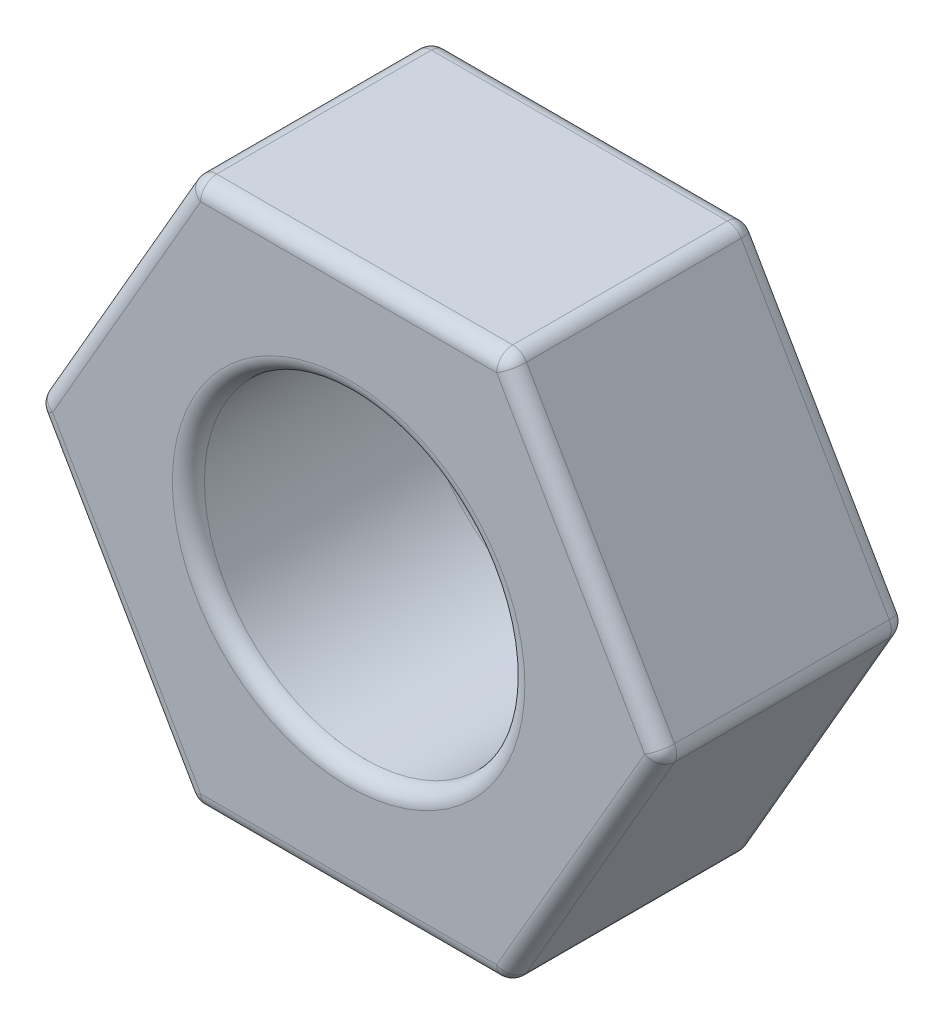
ISO-10303-21;
HEADER;
FILE_DESCRIPTION(('STEP AP214'),'2;1');
FILE_NAME('part.step','',(''),(''),'','','');
FILE_SCHEMA(('AUTOMOTIVE_DESIGN { 1 0 10303 214 1 1 1 1 }'));
ENDSEC;
DATA;
#1=APPLICATION_CONTEXT('core data for automotive mechanical design processes');
#2=APPLICATION_PROTOCOL_DEFINITION('international standard','automotive_design',2000,#1);
#3=PRODUCT_CONTEXT('',#1,'mechanical');
#4=PRODUCT('Part','Part','',(#3));
#5=PRODUCT_RELATED_PRODUCT_CATEGORY('part','',(#4));
#6=PRODUCT_DEFINITION_FORMATION('','',#4);
#7=PRODUCT_DEFINITION_CONTEXT('part definition',#1,'design');
#8=PRODUCT_DEFINITION('design','',#6,#7);
#9=PRODUCT_DEFINITION_SHAPE('','',#8);
#10=(LENGTH_UNIT() NAMED_UNIT(*) SI_UNIT(.MILLI.,.METRE.));
#11=(NAMED_UNIT(*) PLANE_ANGLE_UNIT() SI_UNIT($,.RADIAN.));
#12=(NAMED_UNIT(*) SI_UNIT($,.STERADIAN.) SOLID_ANGLE_UNIT());
#13=UNCERTAINTY_MEASURE_WITH_UNIT(LENGTH_MEASURE(1.E-05),#10,'distance_accuracy_value','');
#14=(GEOMETRIC_REPRESENTATION_CONTEXT(3) GLOBAL_UNCERTAINTY_ASSIGNED_CONTEXT((#13)) GLOBAL_UNIT_ASSIGNED_CONTEXT((#10,
#11,#12)) REPRESENTATION_CONTEXT('',''));
#15=CARTESIAN_POINT('',(0.,0.,0.));
#16=DIRECTION('',(0.,0.,1.));
#17=DIRECTION('',(1.,0.,0.));
#18=AXIS2_PLACEMENT_3D('',#15,#16,#17);
#19=CARTESIAN_POINT('',(0.,0.,3.85));
#20=DIRECTION('',(0.,0.,1.));
#21=DIRECTION('',(1.,0.,0.));
#22=AXIS2_PLACEMENT_3D('',#19,#20,#21);
#23=PLANE('',#22);
#24=DIRECTION('',(-0.500000000000007,0.866025403784435,0.));
#25=VECTOR('',#24,1.);
#26=CARTESIAN_POINT('',(4.47446458621952,8.25000000000004,3.85));
#27=LINE('',#26,#25);
#28=CARTESIAN_POINT('',(9.23760430703401,0.,3.85));
#29=VERTEX_POINT('',#28);
#30=CARTESIAN_POINT('',(4.61880215351693,8.00000000000004,3.85));
#31=VERTEX_POINT('',#30);
#32=EDGE_CURVE('E256',#29,#31,#27,.T.);
#33=ORIENTED_EDGE('',*,*,#32,.T.);
#34=DIRECTION('',(-1.,0.,0.));
#35=VECTOR('',#34,1.);
#36=CARTESIAN_POINT('',(-4.90747728811191,7.99999999999994,3.85));
#37=LINE('',#36,#35);
#38=CARTESIAN_POINT('',(-4.6188021535171,7.99999999999995,3.85));
#39=VERTEX_POINT('',#38);
#40=EDGE_CURVE('E258',#31,#39,#37,.T.);
#41=ORIENTED_EDGE('',*,*,#40,.T.);
#42=DIRECTION('',(-0.499999999999995,-0.866025403784442,0.));
#43=VECTOR('',#42,1.);
#44=CARTESIAN_POINT('',(-9.38194187433142,-0.249999999999998,3.85));
#45=LINE('',#44,#43);
#46=CARTESIAN_POINT('',(-9.23760430703402,0.,3.85));
#47=VERTEX_POINT('',#46);
#48=EDGE_CURVE('E248',#39,#47,#45,.T.);
#49=ORIENTED_EDGE('',*,*,#48,.T.);
#50=DIRECTION('',(0.500000000000001,-0.866025403784438,0.));
#51=VECTOR('',#50,1.);
#52=CARTESIAN_POINT('',(-4.47446458621958,-8.25000000000001,3.85));
#53=LINE('',#52,#51);
#54=CARTESIAN_POINT('',(-4.61880215351699,-8.00000000000001,3.85));
#55=VERTEX_POINT('',#54);
#56=EDGE_CURVE('E250',#47,#55,#53,.T.);
#57=ORIENTED_EDGE('',*,*,#56,.T.);
#58=DIRECTION('',(1.,0.,0.));
#59=VECTOR('',#58,1.);
#60=CARTESIAN_POINT('',(4.90747728811186,-7.99999999999998,3.85));
#61=LINE('',#60,#59);
#62=CARTESIAN_POINT('',(4.61880215351704,-7.99999999999998,3.85));
#63=VERTEX_POINT('',#62);
#64=EDGE_CURVE('E252',#55,#63,#61,.T.);
#65=ORIENTED_EDGE('',*,*,#64,.T.);
#66=DIRECTION('',(0.499999999999995,0.866025403784442,0.));
#67=VECTOR('',#66,1.);
#68=CARTESIAN_POINT('',(9.38194187433142,0.250000000000067,3.85));
#69=LINE('',#68,#67);
#70=EDGE_CURVE('E254',#63,#29,#69,.T.);
#71=ORIENTED_EDGE('',*,*,#70,.T.);
#72=EDGE_LOOP('',(#33,#41,#49,#57,#65,#71));
#73=FACE_BOUND('',#72,.T.);
#74=CARTESIAN_POINT('',(0.,0.,3.85));
#75=DIRECTION('',(0.,0.,1.));
#76=DIRECTION('',(1.,0.,0.));
#77=AXIS2_PLACEMENT_3D('',#74,#75,#76);
#78=CIRCLE('',#77,5.5);
#79=CARTESIAN_POINT('',(5.5,0.,3.85));
#80=VERTEX_POINT('',#79);
#81=EDGE_CURVE('E245',#80,#80,#78,.F.);
#82=ORIENTED_EDGE('',*,*,#81,.T.);
#83=EDGE_LOOP('',(#82));
#84=FACE_BOUND('',#83,.T.);
#85=ADVANCED_FACE('F34',(#73,#84),#23,.T.);
#86=CARTESIAN_POINT('',(0.,0.,-3.85));
#87=DIRECTION('',(0.,0.,1.));
#88=DIRECTION('',(1.,0.,0.));
#89=AXIS2_PLACEMENT_3D('',#86,#87,#88);
#90=PLANE('',#89);
#91=DIRECTION('',(-0.499999999999995,-0.866025403784442,0.));
#92=VECTOR('',#91,1.);
#93=CARTESIAN_POINT('',(-6.92820323027556,3.99999999999998,-3.85));
#94=LINE('',#93,#92);
#95=CARTESIAN_POINT('',(-9.23760430703402,0.,-3.85));
#96=VERTEX_POINT('',#95);
#97=CARTESIAN_POINT('',(-4.6188021535171,7.99999999999995,-3.85));
#98=VERTEX_POINT('',#97);
#99=EDGE_CURVE('E264',#96,#98,#94,.F.);
#100=ORIENTED_EDGE('',*,*,#99,.T.);
#101=DIRECTION('',(-1.,0.,0.));
#102=VECTOR('',#101,1.);
#103=CARTESIAN_POINT('',(0.,7.99999999999999,-3.85));
#104=LINE('',#103,#102);
#105=CARTESIAN_POINT('',(4.61880215351693,8.00000000000004,-3.85));
#106=VERTEX_POINT('',#105);
#107=EDGE_CURVE('E273',#98,#106,#104,.F.);
#108=ORIENTED_EDGE('',*,*,#107,.T.);
#109=DIRECTION('',(-0.500000000000007,0.866025403784435,0.));
#110=VECTOR('',#109,1.);
#111=CARTESIAN_POINT('',(6.92820323027547,4.00000000000005,-3.85));
#112=LINE('',#111,#110);
#113=CARTESIAN_POINT('',(9.23760430703401,0.,-3.85));
#114=VERTEX_POINT('',#113);
#115=EDGE_CURVE('E59',#106,#114,#112,.F.);
#116=ORIENTED_EDGE('',*,*,#115,.T.);
#117=DIRECTION('',(0.499999999999995,0.866025403784442,0.));
#118=VECTOR('',#117,1.);
#119=CARTESIAN_POINT('',(6.92820323027553,-3.99999999999996,-3.85));
#120=LINE('',#119,#118);
#121=CARTESIAN_POINT('',(4.61880215351704,-7.99999999999998,-3.85));
#122=VERTEX_POINT('',#121);
#123=EDGE_CURVE('E270',#114,#122,#120,.F.);
#124=ORIENTED_EDGE('',*,*,#123,.T.);
#125=DIRECTION('',(1.,0.,0.));
#126=VECTOR('',#125,1.);
#127=CARTESIAN_POINT('',(0.,-7.99999999999999,-3.85));
#128=LINE('',#127,#126);
#129=CARTESIAN_POINT('',(-4.61880215351699,-8.00000000000001,-3.85));
#130=VERTEX_POINT('',#129);
#131=EDGE_CURVE('E268',#122,#130,#128,.F.);
#132=ORIENTED_EDGE('',*,*,#131,.T.);
#133=DIRECTION('',(0.500000000000001,-0.866025403784438,0.));
#134=VECTOR('',#133,1.);
#135=CARTESIAN_POINT('',(-6.9282032302755,-4.00000000000001,-3.85));
#136=LINE('',#135,#134);
#137=EDGE_CURVE('E266',#130,#96,#136,.F.);
#138=ORIENTED_EDGE('',*,*,#137,.T.);
#139=EDGE_LOOP('',(#100,#108,#116,#124,#132,#138));
#140=FACE_BOUND('',#139,.T.);
#141=CARTESIAN_POINT('',(0.,0.,-3.85));
#142=DIRECTION('',(0.,0.,1.));
#143=DIRECTION('',(1.,0.,0.));
#144=AXIS2_PLACEMENT_3D('',#141,#142,#143);
#145=CIRCLE('',#144,5.5);
#146=CARTESIAN_POINT('',(5.5,0.,-3.85));
#147=VERTEX_POINT('',#146);
#148=EDGE_CURVE('E261',#147,#147,#145,.T.);
#149=ORIENTED_EDGE('',*,*,#148,.T.);
#150=EDGE_LOOP('',(#149));
#151=FACE_BOUND('',#150,.T.);
#152=ADVANCED_FACE('F433',(#140,#151),#90,.F.);
#153=CARTESIAN_POINT('',(-4.90747728811192,8.49999999999994,3.85));
#154=DIRECTION('',(0.866025403784442,-0.499999999999995,0.));
#155=DIRECTION('',(0.499999999999995,0.866025403784442,0.));
#156=AXIS2_PLACEMENT_3D('',#153,#154,#155);
#157=PLANE('',#156);
#158=DIRECTION('',(0.,0.,-1.));
#159=VECTOR('',#158,1.);
#160=CARTESIAN_POINT('',(-9.67061700892623,0.249999999999999,3.85));
#161=LINE('',#160,#159);
#162=CARTESIAN_POINT('',(-9.67061700892623,0.25,-3.35));
#163=VERTEX_POINT('',#162);
#164=CARTESIAN_POINT('',(-9.67061700892623,0.25,3.35));
#165=VERTEX_POINT('',#164);
#166=EDGE_CURVE('E170',#163,#165,#161,.F.);
#167=ORIENTED_EDGE('',*,*,#166,.T.);
#168=DIRECTION('',(-0.499999999999995,-0.866025403784442,0.));
#169=VECTOR('',#168,1.);
#170=CARTESIAN_POINT('',(-4.90747728811192,8.49999999999994,3.35));
#171=LINE('',#170,#169);
#172=CARTESIAN_POINT('',(-5.05181485540932,8.24999999999994,3.35));
#173=VERTEX_POINT('',#172);
#174=EDGE_CURVE('E207',#165,#173,#171,.F.);
#175=ORIENTED_EDGE('',*,*,#174,.T.);
#176=DIRECTION('',(0.,0.,-1.));
#177=VECTOR('',#176,1.);
#178=CARTESIAN_POINT('',(-5.05181485540932,8.24999999999994,3.85));
#179=LINE('',#178,#177);
#180=CARTESIAN_POINT('',(-5.05181485540932,8.24999999999994,-3.35));
#181=VERTEX_POINT('',#180);
#182=EDGE_CURVE('E204',#173,#181,#179,.T.);
#183=ORIENTED_EDGE('',*,*,#182,.T.);
#184=DIRECTION('',(-0.499999999999995,-0.866025403784442,0.));
#185=VECTOR('',#184,1.);
#186=CARTESIAN_POINT('',(-4.90747728811192,8.49999999999994,-3.35));
#187=LINE('',#186,#185);
#188=EDGE_CURVE('E199',#181,#163,#187,.T.);
#189=ORIENTED_EDGE('',*,*,#188,.T.);
#190=EDGE_LOOP('',(#167,#175,#183,#189));
#191=FACE_BOUND('',#190,.T.);
#192=ADVANCED_FACE('F438',(#191),#157,.F.);
#193=CARTESIAN_POINT('',(-9.81495457622364,0.,3.85));
#194=DIRECTION('',(0.866025403784438,0.500000000000001,0.));
#195=DIRECTION('',(-0.500000000000001,0.866025403784438,0.));
#196=AXIS2_PLACEMENT_3D('',#193,#194,#195);
#197=PLANE('',#196);
#198=DIRECTION('',(0.,0.,-1.));
#199=VECTOR('',#198,1.);
#200=CARTESIAN_POINT('',(-5.05181485540921,-8.25000000000001,3.85));
#201=LINE('',#200,#199);
#202=CARTESIAN_POINT('',(-5.05181485540921,-8.25000000000001,-3.35));
#203=VERTEX_POINT('',#202);
#204=CARTESIAN_POINT('',(-5.05181485540921,-8.25000000000001,3.35));
#205=VERTEX_POINT('',#204);
#206=EDGE_CURVE('E192',#203,#205,#201,.F.);
#207=ORIENTED_EDGE('',*,*,#206,.T.);
#208=DIRECTION('',(0.500000000000001,-0.866025403784438,0.));
#209=VECTOR('',#208,1.);
#210=CARTESIAN_POINT('',(-9.81495457622364,0.,3.35));
#211=LINE('',#210,#209);
#212=CARTESIAN_POINT('',(-9.67061700892623,-0.249999999999997,3.35));
#213=VERTEX_POINT('',#212);
#214=EDGE_CURVE('E196',#205,#213,#211,.F.);
#215=ORIENTED_EDGE('',*,*,#214,.T.);
#216=DIRECTION('',(0.,0.,-1.));
#217=VECTOR('',#216,1.);
#218=CARTESIAN_POINT('',(-9.67061700892623,-0.249999999999997,3.85));
#219=LINE('',#218,#217);
#220=CARTESIAN_POINT('',(-9.67061700892623,-0.249999999999997,-3.35));
#221=VERTEX_POINT('',#220);
#222=EDGE_CURVE('E168',#213,#221,#219,.T.);
#223=ORIENTED_EDGE('',*,*,#222,.T.);
#224=DIRECTION('',(0.500000000000001,-0.866025403784438,0.));
#225=VECTOR('',#224,1.);
#226=CARTESIAN_POINT('',(-9.81495457622364,0.,-3.35));
#227=LINE('',#226,#225);
#228=EDGE_CURVE('E186',#221,#203,#227,.T.);
#229=ORIENTED_EDGE('',*,*,#228,.T.);
#230=EDGE_LOOP('',(#207,#215,#223,#229));
#231=FACE_BOUND('',#230,.T.);
#232=ADVANCED_FACE('F194',(#231),#197,.F.);
#233=CARTESIAN_POINT('',(-4.9074772881118,-8.50000000000001,3.85));
#234=DIRECTION('',(0.,1.,0.));
#235=DIRECTION('',(-1.,0.,0.));
#236=AXIS2_PLACEMENT_3D('',#233,#234,#235);
#237=PLANE('',#236);
#238=DIRECTION('',(0.,0.,-1.));
#239=VECTOR('',#238,1.);
#240=CARTESIAN_POINT('',(4.61880215351705,-8.49999999999998,3.85));
#241=LINE('',#240,#239);
#242=CARTESIAN_POINT('',(4.61880215351705,-8.49999999999998,-3.35));
#243=VERTEX_POINT('',#242);
#244=CARTESIAN_POINT('',(4.61880215351705,-8.49999999999998,3.35));
#245=VERTEX_POINT('',#244);
#246=EDGE_CURVE('E211',#243,#245,#241,.F.);
#247=ORIENTED_EDGE('',*,*,#246,.T.);
#248=DIRECTION('',(1.,0.,0.));
#249=VECTOR('',#248,1.);
#250=CARTESIAN_POINT('',(-4.9074772881118,-8.50000000000001,3.35));
#251=LINE('',#250,#249);
#252=CARTESIAN_POINT('',(-4.61880215351698,-8.50000000000001,3.35));
#253=VERTEX_POINT('',#252);
#254=EDGE_CURVE('E216',#245,#253,#251,.F.);
#255=ORIENTED_EDGE('',*,*,#254,.T.);
#256=DIRECTION('',(0.,0.,-1.));
#257=VECTOR('',#256,1.);
#258=CARTESIAN_POINT('',(-4.61880215351698,-8.50000000000001,3.85));
#259=LINE('',#258,#257);
#260=CARTESIAN_POINT('',(-4.61880215351698,-8.50000000000001,-3.35));
#261=VERTEX_POINT('',#260);
#262=EDGE_CURVE('E213',#253,#261,#259,.T.);
#263=ORIENTED_EDGE('',*,*,#262,.T.);
#264=DIRECTION('',(1.,0.,0.));
#265=VECTOR('',#264,1.);
#266=CARTESIAN_POINT('',(-4.9074772881118,-8.50000000000001,-3.35));
#267=LINE('',#266,#265);
#268=EDGE_CURVE('E209',#261,#243,#267,.T.);
#269=ORIENTED_EDGE('',*,*,#268,.T.);
#270=EDGE_LOOP('',(#247,#255,#263,#269));
#271=FACE_BOUND('',#270,.T.);
#272=ADVANCED_FACE('F451',(#271),#237,.F.);
#273=CARTESIAN_POINT('',(4.90747728811186,-8.49999999999998,3.85));
#274=DIRECTION('',(-0.866025403784442,0.499999999999995,0.));
#275=DIRECTION('',(-0.499999999999995,-0.866025403784442,0.));
#276=AXIS2_PLACEMENT_3D('',#273,#274,#275);
#277=PLANE('',#276);
#278=DIRECTION('',(0.,0.,-1.));
#279=VECTOR('',#278,1.);
#280=CARTESIAN_POINT('',(9.67061700892623,-0.249999999999933,3.85));
#281=LINE('',#280,#279);
#282=CARTESIAN_POINT('',(9.67061700892623,-0.249999999999934,-3.35));
#283=VERTEX_POINT('',#282);
#284=CARTESIAN_POINT('',(9.67061700892623,-0.249999999999933,3.35));
#285=VERTEX_POINT('',#284);
#286=EDGE_CURVE('E220',#283,#285,#281,.F.);
#287=ORIENTED_EDGE('',*,*,#286,.T.);
#288=DIRECTION('',(0.499999999999995,0.866025403784442,0.));
#289=VECTOR('',#288,1.);
#290=CARTESIAN_POINT('',(4.90747728811186,-8.49999999999998,3.35));
#291=LINE('',#290,#289);
#292=CARTESIAN_POINT('',(5.05181485540926,-8.24999999999998,3.35));
#293=VERTEX_POINT('',#292);
#294=EDGE_CURVE('E225',#285,#293,#291,.F.);
#295=ORIENTED_EDGE('',*,*,#294,.T.);
#296=DIRECTION('',(0.,0.,-1.));
#297=VECTOR('',#296,1.);
#298=CARTESIAN_POINT('',(5.05181485540926,-8.24999999999998,3.85));
#299=LINE('',#298,#297);
#300=CARTESIAN_POINT('',(5.05181485540926,-8.24999999999998,-3.35));
#301=VERTEX_POINT('',#300);
#302=EDGE_CURVE('E222',#293,#301,#299,.T.);
#303=ORIENTED_EDGE('',*,*,#302,.T.);
#304=DIRECTION('',(0.499999999999995,0.866025403784442,0.));
#305=VECTOR('',#304,1.);
#306=CARTESIAN_POINT('',(4.90747728811186,-8.49999999999998,-3.35));
#307=LINE('',#306,#305);
#308=EDGE_CURVE('E218',#301,#283,#307,.T.);
#309=ORIENTED_EDGE('',*,*,#308,.T.);
#310=EDGE_LOOP('',(#287,#295,#303,#309));
#311=FACE_BOUND('',#310,.T.);
#312=ADVANCED_FACE('F392',(#311),#277,.F.);
#313=CARTESIAN_POINT('',(9.81495457622364,0.,3.85));
#314=DIRECTION('',(-0.866025403784435,-0.500000000000007,0.));
#315=DIRECTION('',(0.500000000000007,-0.866025403784435,0.));
#316=AXIS2_PLACEMENT_3D('',#313,#314,#315);
#317=PLANE('',#316);
#318=DIRECTION('',(0.,0.,-1.));
#319=VECTOR('',#318,1.);
#320=CARTESIAN_POINT('',(5.05181485540915,8.25000000000005,3.85));
#321=LINE('',#320,#319);
#322=CARTESIAN_POINT('',(5.05181485540915,8.25000000000005,-3.35));
#323=VERTEX_POINT('',#322);
#324=CARTESIAN_POINT('',(5.05181485540915,8.25000000000005,3.35));
#325=VERTEX_POINT('',#324);
#326=EDGE_CURVE('E229',#323,#325,#321,.F.);
#327=ORIENTED_EDGE('',*,*,#326,.T.);
#328=DIRECTION('',(-0.500000000000007,0.866025403784435,0.));
#329=VECTOR('',#328,1.);
#330=CARTESIAN_POINT('',(9.81495457622364,0.,3.35));
#331=LINE('',#330,#329);
#332=CARTESIAN_POINT('',(9.67061700892623,0.250000000000067,3.35));
#333=VERTEX_POINT('',#332);
#334=EDGE_CURVE('E234',#325,#333,#331,.F.);
#335=ORIENTED_EDGE('',*,*,#334,.T.);
#336=DIRECTION('',(0.,0.,-1.));
#337=VECTOR('',#336,1.);
#338=CARTESIAN_POINT('',(9.67061700892623,0.250000000000067,3.85));
#339=LINE('',#338,#337);
#340=CARTESIAN_POINT('',(9.67061700892623,0.250000000000067,-3.35));
#341=VERTEX_POINT('',#340);
#342=EDGE_CURVE('E231',#333,#341,#339,.T.);
#343=ORIENTED_EDGE('',*,*,#342,.T.);
#344=DIRECTION('',(-0.500000000000007,0.866025403784435,0.));
#345=VECTOR('',#344,1.);
#346=CARTESIAN_POINT('',(9.81495457622364,0.,-3.35));
#347=LINE('',#346,#345);
#348=EDGE_CURVE('E227',#341,#323,#347,.T.);
#349=ORIENTED_EDGE('',*,*,#348,.T.);
#350=EDGE_LOOP('',(#327,#335,#343,#349));
#351=FACE_BOUND('',#350,.T.);
#352=ADVANCED_FACE('F408',(#351),#317,.F.);
#353=CARTESIAN_POINT('',(4.90747728811174,8.50000000000005,3.85));
#354=DIRECTION('',(0.,-1.,0.));
#355=DIRECTION('',(1.,0.,0.));
#356=AXIS2_PLACEMENT_3D('',#353,#354,#355);
#357=PLANE('',#356);
#358=DIRECTION('',(0.,0.,-1.));
#359=VECTOR('',#358,1.);
#360=CARTESIAN_POINT('',(-4.61880215351711,8.49999999999995,3.85));
#361=LINE('',#360,#359);
#362=CARTESIAN_POINT('',(-4.61880215351711,8.49999999999995,-3.35));
#363=VERTEX_POINT('',#362);
#364=CARTESIAN_POINT('',(-4.61880215351711,8.49999999999995,3.35));
#365=VERTEX_POINT('',#364);
#366=EDGE_CURVE('E238',#363,#365,#361,.F.);
#367=ORIENTED_EDGE('',*,*,#366,.T.);
#368=DIRECTION('',(-1.,0.,0.));
#369=VECTOR('',#368,1.);
#370=CARTESIAN_POINT('',(4.90747728811174,8.50000000000005,3.35));
#371=LINE('',#370,#369);
#372=CARTESIAN_POINT('',(4.61880215351693,8.50000000000004,3.35));
#373=VERTEX_POINT('',#372);
#374=EDGE_CURVE('E243',#365,#373,#371,.F.);
#375=ORIENTED_EDGE('',*,*,#374,.T.);
#376=DIRECTION('',(0.,0.,-1.));
#377=VECTOR('',#376,1.);
#378=CARTESIAN_POINT('',(4.61880215351693,8.50000000000004,3.85));
#379=LINE('',#378,#377);
#380=CARTESIAN_POINT('',(4.61880215351693,8.50000000000004,-3.35));
#381=VERTEX_POINT('',#380);
#382=EDGE_CURVE('E240',#373,#381,#379,.T.);
#383=ORIENTED_EDGE('',*,*,#382,.T.);
#384=DIRECTION('',(-1.,0.,0.));
#385=VECTOR('',#384,1.);
#386=CARTESIAN_POINT('',(4.90747728811174,8.50000000000005,-3.35));
#387=LINE('',#386,#385);
#388=EDGE_CURVE('E236',#381,#363,#387,.T.);
#389=ORIENTED_EDGE('',*,*,#388,.T.);
#390=EDGE_LOOP('',(#367,#375,#383,#389));
#391=FACE_BOUND('',#390,.T.);
#392=ADVANCED_FACE('F443',(#391),#357,.F.);
#393=CARTESIAN_POINT('',(0.,0.,3.85));
#394=DIRECTION('',(0.,0.,-1.));
#395=DIRECTION('',(-1.,0.,0.));
#396=AXIS2_PLACEMENT_3D('',#393,#394,#395);
#397=CYLINDRICAL_SURFACE('',#396,5.);
#398=CARTESIAN_POINT('',(0.,0.,3.35));
#399=DIRECTION('',(0.,0.,1.));
#400=DIRECTION('',(1.,0.,0.));
#401=AXIS2_PLACEMENT_3D('',#398,#399,#400);
#402=CIRCLE('',#401,5.);
#403=CARTESIAN_POINT('',(5.,0.,3.35));
#404=VERTEX_POINT('',#403);
#405=EDGE_CURVE('E11',#404,#404,#402,.T.);
#406=ORIENTED_EDGE('',*,*,#405,.T.);
#407=EDGE_LOOP('',(#406));
#408=FACE_BOUND('',#407,.T.);
#409=CARTESIAN_POINT('',(0.,0.,-3.35));
#410=DIRECTION('',(0.,0.,1.));
#411=DIRECTION('',(1.,0.,0.));
#412=AXIS2_PLACEMENT_3D('',#409,#410,#411);
#413=CIRCLE('',#412,5.);
#414=CARTESIAN_POINT('',(5.,0.,-3.35));
#415=VERTEX_POINT('',#414);
#416=EDGE_CURVE('E43',#415,#415,#413,.F.);
#417=ORIENTED_EDGE('',*,*,#416,.T.);
#418=EDGE_LOOP('',(#417));
#419=FACE_BOUND('',#418,.T.);
#420=ADVANCED_FACE('F441',(#408,#419),#397,.F.);
#421=CARTESIAN_POINT('',(9.23760430703401,0.,3.85));
#422=DIRECTION('',(0.,0.,-1.));
#423=DIRECTION('',(-1.,0.,0.));
#424=AXIS2_PLACEMENT_3D('',#421,#422,#423);
#425=CYLINDRICAL_SURFACE('',#424,0.5);
#426=CARTESIAN_POINT('',(9.23760430703401,0.,3.35));
#427=DIRECTION('',(0.,0.,1.));
#428=DIRECTION('',(1.,0.,0.));
#429=AXIS2_PLACEMENT_3D('',#426,#427,#428);
#430=CIRCLE('',#429,0.5);
#431=EDGE_CURVE('E38',#285,#333,#430,.T.);
#432=ORIENTED_EDGE('',*,*,#431,.F.);
#433=ORIENTED_EDGE('',*,*,#286,.F.);
#434=CARTESIAN_POINT('',(9.23760430703401,0.,-3.35));
#435=DIRECTION('',(0.,0.,-1.));
#436=DIRECTION('',(-1.,0.,0.));
#437=AXIS2_PLACEMENT_3D('',#434,#435,#436);
#438=CIRCLE('',#437,0.5);
#439=EDGE_CURVE('E359',#341,#283,#438,.T.);
#440=ORIENTED_EDGE('',*,*,#439,.F.);
#441=ORIENTED_EDGE('',*,*,#342,.F.);
#442=EDGE_LOOP('',(#432,#433,#440,#441));
#443=FACE_BOUND('',#442,.T.);
#444=ADVANCED_FACE('F406',(#443),#425,.T.);
#445=CARTESIAN_POINT('',(9.23760430703401,0.,3.35));
#446=DIRECTION('',(0.,0.,1.));
#447=DIRECTION('',(1.,0.,0.));
#448=AXIS2_PLACEMENT_3D('',#445,#446,#447);
#449=SPHERICAL_SURFACE('',#448,0.5);
#450=CARTESIAN_POINT('',(9.23760430703401,0.,3.35));
#451=DIRECTION('',(0.499999999999998,0.86602540378444,0.));
#452=DIRECTION('',(-0.86602540378444,0.499999999999998,0.));
#453=AXIS2_PLACEMENT_3D('',#450,#451,#452);
#454=CIRCLE('',#453,0.5);
#455=EDGE_CURVE('E354',#285,#29,#454,.F.);
#456=ORIENTED_EDGE('',*,*,#455,.F.);
#457=ORIENTED_EDGE('',*,*,#431,.T.);
#458=CARTESIAN_POINT('',(9.23760430703401,0.,3.35));
#459=DIRECTION('',(0.500000000000006,-0.866025403784435,0.));
#460=DIRECTION('',(0.866025403784435,0.500000000000007,0.));
#461=AXIS2_PLACEMENT_3D('',#458,#459,#460);
#462=CIRCLE('',#461,0.5);
#463=EDGE_CURVE('E357',#29,#333,#462,.F.);
#464=ORIENTED_EDGE('',*,*,#463,.F.);
#465=EDGE_LOOP('',(#456,#457,#464));
#466=FACE_BOUND('',#465,.T.);
#467=ADVANCED_FACE('F370',(#466),#449,.T.);
#468=CARTESIAN_POINT('',(9.23760430703401,0.,-3.35));
#469=DIRECTION('',(0.,0.,1.));
#470=DIRECTION('',(1.,0.,0.));
#471=AXIS2_PLACEMENT_3D('',#468,#469,#470);
#472=SPHERICAL_SURFACE('',#471,0.5);
#473=CARTESIAN_POINT('',(9.23760430703401,0.,-3.35));
#474=DIRECTION('',(0.500000000000006,-0.866025403784435,0.));
#475=DIRECTION('',(0.866025403784435,0.500000000000007,0.));
#476=AXIS2_PLACEMENT_3D('',#473,#474,#475);
#477=CIRCLE('',#476,0.5);
#478=EDGE_CURVE('E349',#341,#114,#477,.F.);
#479=ORIENTED_EDGE('',*,*,#478,.F.);
#480=ORIENTED_EDGE('',*,*,#439,.T.);
#481=CARTESIAN_POINT('',(9.23760430703401,0.,-3.35));
#482=DIRECTION('',(0.499999999999994,0.866025403784442,0.));
#483=DIRECTION('',(-0.866025403784442,0.499999999999994,0.));
#484=AXIS2_PLACEMENT_3D('',#481,#482,#483);
#485=CIRCLE('',#484,0.5);
#486=EDGE_CURVE('E351',#114,#283,#485,.F.);
#487=ORIENTED_EDGE('',*,*,#486,.F.);
#488=EDGE_LOOP('',(#479,#480,#487));
#489=FACE_BOUND('',#488,.T.);
#490=ADVANCED_FACE('F542',(#489),#472,.T.);
#491=CARTESIAN_POINT('',(6.92820323027547,4.00000000000005,3.35));
#492=DIRECTION('',(0.500000000000007,-0.866025403784435,0.));
#493=DIRECTION('',(0.866025403784435,0.500000000000007,0.));
#494=AXIS2_PLACEMENT_3D('',#491,#492,#493);
#495=CYLINDRICAL_SURFACE('',#494,0.5);
#496=ORIENTED_EDGE('',*,*,#463,.T.);
#497=ORIENTED_EDGE('',*,*,#334,.F.);
#498=CARTESIAN_POINT('',(4.61880215351693,8.00000000000004,3.35));
#499=DIRECTION('',(-0.500000000000007,0.866025403784435,0.));
#500=DIRECTION('',(-0.866025403784435,-0.500000000000007,0.));
#501=AXIS2_PLACEMENT_3D('',#498,#499,#500);
#502=CIRCLE('',#501,0.5);
#503=EDGE_CURVE('E343',#31,#325,#502,.T.);
#504=ORIENTED_EDGE('',*,*,#503,.F.);
#505=ORIENTED_EDGE('',*,*,#32,.F.);
#506=EDGE_LOOP('',(#496,#497,#504,#505));
#507=FACE_BOUND('',#506,.T.);
#508=ADVANCED_FACE('F378',(#507),#495,.T.);
#509=CARTESIAN_POINT('',(6.92820323027553,-3.99999999999996,3.35));
#510=DIRECTION('',(-0.499999999999995,-0.866025403784442,0.));
#511=DIRECTION('',(0.866025403784442,-0.499999999999995,0.));
#512=AXIS2_PLACEMENT_3D('',#509,#510,#511);
#513=CYLINDRICAL_SURFACE('',#512,0.5);
#514=ORIENTED_EDGE('',*,*,#455,.T.);
#515=ORIENTED_EDGE('',*,*,#70,.F.);
#516=CARTESIAN_POINT('',(4.61880215351704,-7.99999999999998,3.35));
#517=DIRECTION('',(-0.499999999999994,-0.866025403784442,0.));
#518=DIRECTION('',(0.866025403784442,-0.499999999999994,0.));
#519=AXIS2_PLACEMENT_3D('',#516,#517,#518);
#520=CIRCLE('',#519,0.5);
#521=EDGE_CURVE('E340',#293,#63,#520,.T.);
#522=ORIENTED_EDGE('',*,*,#521,.F.);
#523=ORIENTED_EDGE('',*,*,#294,.F.);
#524=EDGE_LOOP('',(#514,#515,#522,#523));
#525=FACE_BOUND('',#524,.T.);
#526=ADVANCED_FACE('F389',(#525),#513,.T.);
#527=CARTESIAN_POINT('',(4.61880215351704,-7.99999999999998,3.85));
#528=DIRECTION('',(0.,0.,-1.));
#529=DIRECTION('',(-1.,0.,0.));
#530=AXIS2_PLACEMENT_3D('',#527,#528,#529);
#531=CYLINDRICAL_SURFACE('',#530,0.5);
#532=CARTESIAN_POINT('',(4.61880215351704,-7.99999999999998,-3.35));
#533=DIRECTION('',(0.,0.,-1.));
#534=DIRECTION('',(-1.,0.,0.));
#535=AXIS2_PLACEMENT_3D('',#532,#533,#534);
#536=CIRCLE('',#535,0.5);
#537=EDGE_CURVE('E334',#301,#243,#536,.T.);
#538=ORIENTED_EDGE('',*,*,#537,.F.);
#539=ORIENTED_EDGE('',*,*,#302,.F.);
#540=CARTESIAN_POINT('',(4.61880215351704,-7.99999999999998,3.35));
#541=DIRECTION('',(0.,0.,1.));
#542=DIRECTION('',(1.,0.,0.));
#543=AXIS2_PLACEMENT_3D('',#540,#541,#542);
#544=CIRCLE('',#543,0.5);
#545=EDGE_CURVE('E337',#245,#293,#544,.T.);
#546=ORIENTED_EDGE('',*,*,#545,.F.);
#547=ORIENTED_EDGE('',*,*,#246,.F.);
#548=EDGE_LOOP('',(#538,#539,#546,#547));
#549=FACE_BOUND('',#548,.T.);
#550=ADVANCED_FACE('F396',(#549),#531,.T.);
#551=CARTESIAN_POINT('',(4.47446458621964,-8.24999999999998,-3.35));
#552=DIRECTION('',(0.499999999999995,0.866025403784442,0.));
#553=DIRECTION('',(-0.866025403784442,0.499999999999995,0.));
#554=AXIS2_PLACEMENT_3D('',#551,#552,#553);
#555=CYLINDRICAL_SURFACE('',#554,0.5);
#556=ORIENTED_EDGE('',*,*,#486,.T.);
#557=ORIENTED_EDGE('',*,*,#308,.F.);
#558=CARTESIAN_POINT('',(4.61880215351704,-7.99999999999998,-3.35));
#559=DIRECTION('',(-0.499999999999994,-0.866025403784442,0.));
#560=DIRECTION('',(0.866025403784442,-0.499999999999994,0.));
#561=AXIS2_PLACEMENT_3D('',#558,#559,#560);
#562=CIRCLE('',#561,0.5);
#563=EDGE_CURVE('E332',#122,#301,#562,.T.);
#564=ORIENTED_EDGE('',*,*,#563,.F.);
#565=ORIENTED_EDGE('',*,*,#123,.F.);
#566=EDGE_LOOP('',(#556,#557,#564,#565));
#567=FACE_BOUND('',#566,.T.);
#568=ADVANCED_FACE('F404',(#567),#555,.T.);
#569=CARTESIAN_POINT('',(9.38194187433142,-0.249999999999935,-3.35));
#570=DIRECTION('',(-0.500000000000007,0.866025403784435,0.));
#571=DIRECTION('',(-0.866025403784435,-0.500000000000007,0.));
#572=AXIS2_PLACEMENT_3D('',#569,#570,#571);
#573=CYLINDRICAL_SURFACE('',#572,0.5);
#574=ORIENTED_EDGE('',*,*,#478,.T.);
#575=ORIENTED_EDGE('',*,*,#115,.F.);
#576=CARTESIAN_POINT('',(4.61880215351693,8.00000000000004,-3.35));
#577=DIRECTION('',(-0.500000000000007,0.866025403784434,0.));
#578=DIRECTION('',(-0.866025403784434,-0.500000000000008,0.));
#579=AXIS2_PLACEMENT_3D('',#576,#577,#578);
#580=CIRCLE('',#579,0.5);
#581=EDGE_CURVE('E330',#323,#106,#580,.T.);
#582=ORIENTED_EDGE('',*,*,#581,.F.);
#583=ORIENTED_EDGE('',*,*,#348,.F.);
#584=EDGE_LOOP('',(#574,#575,#582,#583));
#585=FACE_BOUND('',#584,.T.);
#586=ADVANCED_FACE('F416',(#585),#573,.T.);
#587=CARTESIAN_POINT('',(4.61880215351693,8.00000000000004,3.85));
#588=DIRECTION('',(0.,0.,-1.));
#589=DIRECTION('',(-1.,0.,0.));
#590=AXIS2_PLACEMENT_3D('',#587,#588,#589);
#591=CYLINDRICAL_SURFACE('',#590,0.5);
#592=CARTESIAN_POINT('',(4.61880215351693,8.00000000000004,3.35));
#593=DIRECTION('',(0.,0.,1.));
#594=DIRECTION('',(1.,0.,0.));
#595=AXIS2_PLACEMENT_3D('',#592,#593,#594);
#596=CIRCLE('',#595,0.5);
#597=EDGE_CURVE('E346',#325,#373,#596,.T.);
#598=ORIENTED_EDGE('',*,*,#597,.F.);
#599=ORIENTED_EDGE('',*,*,#326,.F.);
#600=CARTESIAN_POINT('',(4.61880215351693,8.00000000000004,-3.35));
#601=DIRECTION('',(0.,0.,-1.));
#602=DIRECTION('',(-1.,0.,0.));
#603=AXIS2_PLACEMENT_3D('',#600,#601,#602);
#604=CIRCLE('',#603,0.5);
#605=EDGE_CURVE('E327',#381,#323,#604,.T.);
#606=ORIENTED_EDGE('',*,*,#605,.F.);
#607=ORIENTED_EDGE('',*,*,#382,.F.);
#608=EDGE_LOOP('',(#598,#599,#606,#607));
#609=FACE_BOUND('',#608,.T.);
#610=ADVANCED_FACE('F413',(#609),#591,.T.);
#611=CARTESIAN_POINT('',(4.61880215351693,8.00000000000004,3.35));
#612=DIRECTION('',(0.,0.,1.));
#613=DIRECTION('',(1.,0.,0.));
#614=AXIS2_PLACEMENT_3D('',#611,#612,#613);
#615=SPHERICAL_SURFACE('',#614,0.5);
#616=ORIENTED_EDGE('',*,*,#503,.T.);
#617=ORIENTED_EDGE('',*,*,#597,.T.);
#618=CARTESIAN_POINT('',(4.61880215351693,8.00000000000004,3.35));
#619=DIRECTION('',(1.,0.,0.));
#620=DIRECTION('',(0.,1.,0.));
#621=AXIS2_PLACEMENT_3D('',#618,#619,#620);
#622=CIRCLE('',#621,0.5);
#623=EDGE_CURVE('E324',#31,#373,#622,.F.);
#624=ORIENTED_EDGE('',*,*,#623,.F.);
#625=EDGE_LOOP('',(#616,#617,#624));
#626=FACE_BOUND('',#625,.T.);
#627=ADVANCED_FACE('F522',(#626),#615,.T.);
#628=CARTESIAN_POINT('',(4.61880215351704,-7.99999999999998,3.35));
#629=DIRECTION('',(0.,0.,1.));
#630=DIRECTION('',(1.,0.,0.));
#631=AXIS2_PLACEMENT_3D('',#628,#629,#630);
#632=SPHERICAL_SURFACE('',#631,0.5);
#633=ORIENTED_EDGE('',*,*,#545,.T.);
#634=ORIENTED_EDGE('',*,*,#521,.T.);
#635=CARTESIAN_POINT('',(4.61880215351704,-7.99999999999998,3.35));
#636=DIRECTION('',(1.,0.,0.));
#637=DIRECTION('',(0.,1.,0.));
#638=AXIS2_PLACEMENT_3D('',#635,#636,#637);
#639=CIRCLE('',#638,0.5);
#640=EDGE_CURVE('E321',#245,#63,#639,.F.);
#641=ORIENTED_EDGE('',*,*,#640,.F.);
#642=EDGE_LOOP('',(#633,#634,#641));
#643=FACE_BOUND('',#642,.T.);
#644=ADVANCED_FACE('F430',(#643),#632,.T.);
#645=CARTESIAN_POINT('',(4.61880215351704,-7.99999999999998,-3.35));
#646=DIRECTION('',(0.,0.,1.));
#647=DIRECTION('',(1.,0.,0.));
#648=AXIS2_PLACEMENT_3D('',#645,#646,#647);
#649=SPHERICAL_SURFACE('',#648,0.5);
#650=ORIENTED_EDGE('',*,*,#563,.T.);
#651=ORIENTED_EDGE('',*,*,#537,.T.);
#652=CARTESIAN_POINT('',(4.61880215351704,-7.99999999999998,-3.35));
#653=DIRECTION('',(1.,0.,0.));
#654=DIRECTION('',(0.,1.,0.));
#655=AXIS2_PLACEMENT_3D('',#652,#653,#654);
#656=CIRCLE('',#655,0.5);
#657=EDGE_CURVE('E318',#122,#243,#656,.F.);
#658=ORIENTED_EDGE('',*,*,#657,.F.);
#659=EDGE_LOOP('',(#650,#651,#658));
#660=FACE_BOUND('',#659,.T.);
#661=ADVANCED_FACE('F421',(#660),#649,.T.);
#662=CARTESIAN_POINT('',(4.61880215351693,8.00000000000004,-3.35));
#663=DIRECTION('',(0.,0.,1.));
#664=DIRECTION('',(1.,0.,0.));
#665=AXIS2_PLACEMENT_3D('',#662,#663,#664);
#666=SPHERICAL_SURFACE('',#665,0.5);
#667=ORIENTED_EDGE('',*,*,#605,.T.);
#668=ORIENTED_EDGE('',*,*,#581,.T.);
#669=CARTESIAN_POINT('',(4.61880215351693,8.00000000000004,-3.35));
#670=DIRECTION('',(1.,0.,0.));
#671=DIRECTION('',(0.,1.,0.));
#672=AXIS2_PLACEMENT_3D('',#669,#670,#671);
#673=CIRCLE('',#672,0.5);
#674=EDGE_CURVE('E51',#381,#106,#673,.F.);
#675=ORIENTED_EDGE('',*,*,#674,.F.);
#676=EDGE_LOOP('',(#667,#668,#675));
#677=FACE_BOUND('',#676,.T.);
#678=ADVANCED_FACE('F418',(#677),#666,.T.);
#679=CARTESIAN_POINT('',(0.,7.99999999999999,3.35));
#680=DIRECTION('',(1.,0.,0.));
#681=DIRECTION('',(0.,1.,0.));
#682=AXIS2_PLACEMENT_3D('',#679,#680,#681);
#683=CYLINDRICAL_SURFACE('',#682,0.5);
#684=ORIENTED_EDGE('',*,*,#623,.T.);
#685=ORIENTED_EDGE('',*,*,#374,.F.);
#686=CARTESIAN_POINT('',(-4.6188021535171,7.99999999999995,3.35));
#687=DIRECTION('',(-1.,0.,0.));
#688=DIRECTION('',(0.,-1.,0.));
#689=AXIS2_PLACEMENT_3D('',#686,#687,#688);
#690=CIRCLE('',#689,0.5);
#691=EDGE_CURVE('E311',#39,#365,#690,.T.);
#692=ORIENTED_EDGE('',*,*,#691,.F.);
#693=ORIENTED_EDGE('',*,*,#40,.F.);
#694=EDGE_LOOP('',(#684,#685,#692,#693));
#695=FACE_BOUND('',#694,.T.);
#696=ADVANCED_FACE('F420',(#695),#683,.T.);
#697=CARTESIAN_POINT('',(0.,-7.99999999999999,3.35));
#698=DIRECTION('',(-1.,0.,0.));
#699=DIRECTION('',(0.,-1.,0.));
#700=AXIS2_PLACEMENT_3D('',#697,#698,#699);
#701=CYLINDRICAL_SURFACE('',#700,0.5);
#702=ORIENTED_EDGE('',*,*,#640,.T.);
#703=ORIENTED_EDGE('',*,*,#64,.F.);
#704=CARTESIAN_POINT('',(-4.61880215351699,-8.00000000000001,3.35));
#705=DIRECTION('',(-1.,0.,0.));
#706=DIRECTION('',(0.,-1.,0.));
#707=AXIS2_PLACEMENT_3D('',#704,#705,#706);
#708=CIRCLE('',#707,0.5);
#709=EDGE_CURVE('E308',#253,#55,#708,.T.);
#710=ORIENTED_EDGE('',*,*,#709,.F.);
#711=ORIENTED_EDGE('',*,*,#254,.F.);
#712=EDGE_LOOP('',(#702,#703,#710,#711));
#713=FACE_BOUND('',#712,.T.);
#714=ADVANCED_FACE('F427',(#713),#701,.T.);
#715=CARTESIAN_POINT('',(-4.61880215351699,-8.00000000000001,3.85));
#716=DIRECTION('',(0.,0.,-1.));
#717=DIRECTION('',(-1.,0.,0.));
#718=AXIS2_PLACEMENT_3D('',#715,#716,#717);
#719=CYLINDRICAL_SURFACE('',#718,0.5);
#720=CARTESIAN_POINT('',(-4.61880215351699,-8.00000000000001,-3.35));
#721=DIRECTION('',(0.,0.,-1.));
#722=DIRECTION('',(-1.,0.,0.));
#723=AXIS2_PLACEMENT_3D('',#720,#721,#722);
#724=CIRCLE('',#723,0.5);
#725=EDGE_CURVE('E302',#261,#203,#724,.T.);
#726=ORIENTED_EDGE('',*,*,#725,.F.);
#727=ORIENTED_EDGE('',*,*,#262,.F.);
#728=CARTESIAN_POINT('',(-4.61880215351699,-8.00000000000001,3.35));
#729=DIRECTION('',(0.,0.,1.));
#730=DIRECTION('',(1.,0.,0.));
#731=AXIS2_PLACEMENT_3D('',#728,#729,#730);
#732=CIRCLE('',#731,0.5);
#733=EDGE_CURVE('E305',#205,#253,#732,.T.);
#734=ORIENTED_EDGE('',*,*,#733,.F.);
#735=ORIENTED_EDGE('',*,*,#206,.F.);
#736=EDGE_LOOP('',(#726,#727,#734,#735));
#737=FACE_BOUND('',#736,.T.);
#738=ADVANCED_FACE('F509',(#737),#719,.T.);
#739=CARTESIAN_POINT('',(-4.9074772881118,-8.00000000000001,-3.35));
#740=DIRECTION('',(1.,0.,0.));
#741=DIRECTION('',(0.,1.,0.));
#742=AXIS2_PLACEMENT_3D('',#739,#740,#741);
#743=CYLINDRICAL_SURFACE('',#742,0.5);
#744=ORIENTED_EDGE('',*,*,#657,.T.);
#745=ORIENTED_EDGE('',*,*,#268,.F.);
#746=CARTESIAN_POINT('',(-4.61880215351699,-8.00000000000001,-3.35));
#747=DIRECTION('',(-1.,0.,0.));
#748=DIRECTION('',(0.,-1.,0.));
#749=AXIS2_PLACEMENT_3D('',#746,#747,#748);
#750=CIRCLE('',#749,0.5);
#751=EDGE_CURVE('E300',#130,#261,#750,.T.);
#752=ORIENTED_EDGE('',*,*,#751,.F.);
#753=ORIENTED_EDGE('',*,*,#131,.F.);
#754=EDGE_LOOP('',(#744,#745,#752,#753));
#755=FACE_BOUND('',#754,.T.);
#756=ADVANCED_FACE('F506',(#755),#743,.T.);
#757=CARTESIAN_POINT('',(4.90747728811175,8.00000000000004,-3.35));
#758=DIRECTION('',(-1.,0.,0.));
#759=DIRECTION('',(0.,-1.,0.));
#760=AXIS2_PLACEMENT_3D('',#757,#758,#759);
#761=CYLINDRICAL_SURFACE('',#760,0.5);
#762=ORIENTED_EDGE('',*,*,#674,.T.);
#763=ORIENTED_EDGE('',*,*,#107,.F.);
#764=CARTESIAN_POINT('',(-4.6188021535171,7.99999999999995,-3.35));
#765=DIRECTION('',(-1.,0.,0.));
#766=DIRECTION('',(0.,-1.,0.));
#767=AXIS2_PLACEMENT_3D('',#764,#765,#766);
#768=CIRCLE('',#767,0.5);
#769=EDGE_CURVE('E297',#363,#98,#768,.T.);
#770=ORIENTED_EDGE('',*,*,#769,.F.);
#771=ORIENTED_EDGE('',*,*,#388,.F.);
#772=EDGE_LOOP('',(#762,#763,#770,#771));
#773=FACE_BOUND('',#772,.T.);
#774=ADVANCED_FACE('F502',(#773),#761,.T.);
#775=CARTESIAN_POINT('',(-4.6188021535171,7.99999999999995,3.85));
#776=DIRECTION('',(0.,0.,-1.));
#777=DIRECTION('',(-1.,0.,0.));
#778=AXIS2_PLACEMENT_3D('',#775,#776,#777);
#779=CYLINDRICAL_SURFACE('',#778,0.5);
#780=CARTESIAN_POINT('',(-4.6188021535171,7.99999999999995,3.35));
#781=DIRECTION('',(0.,0.,1.));
#782=DIRECTION('',(1.,0.,0.));
#783=AXIS2_PLACEMENT_3D('',#780,#781,#782);
#784=CIRCLE('',#783,0.5);
#785=EDGE_CURVE('E314',#365,#173,#784,.T.);
#786=ORIENTED_EDGE('',*,*,#785,.F.);
#787=ORIENTED_EDGE('',*,*,#366,.F.);
#788=CARTESIAN_POINT('',(-4.6188021535171,7.99999999999995,-3.35));
#789=DIRECTION('',(0.,0.,-1.));
#790=DIRECTION('',(-1.,0.,0.));
#791=AXIS2_PLACEMENT_3D('',#788,#789,#790);
#792=CIRCLE('',#791,0.5);
#793=EDGE_CURVE('E294',#181,#363,#792,.T.);
#794=ORIENTED_EDGE('',*,*,#793,.F.);
#795=ORIENTED_EDGE('',*,*,#182,.F.);
#796=EDGE_LOOP('',(#786,#787,#794,#795));
#797=FACE_BOUND('',#796,.T.);
#798=ADVANCED_FACE('F498',(#797),#779,.T.);
#799=CARTESIAN_POINT('',(-4.6188021535171,7.99999999999995,3.35));
#800=DIRECTION('',(0.,0.,1.));
#801=DIRECTION('',(1.,0.,0.));
#802=AXIS2_PLACEMENT_3D('',#799,#800,#801);
#803=SPHERICAL_SURFACE('',#802,0.5);
#804=ORIENTED_EDGE('',*,*,#691,.T.);
#805=ORIENTED_EDGE('',*,*,#785,.T.);
#806=CARTESIAN_POINT('',(-4.6188021535171,7.99999999999995,3.35));
#807=DIRECTION('',(0.499999999999994,0.866025403784442,0.));
#808=DIRECTION('',(-0.866025403784442,0.499999999999994,0.));
#809=AXIS2_PLACEMENT_3D('',#806,#807,#808);
#810=CIRCLE('',#809,0.5);
#811=EDGE_CURVE('E291',#39,#173,#810,.F.);
#812=ORIENTED_EDGE('',*,*,#811,.F.);
#813=EDGE_LOOP('',(#804,#805,#812));
#814=FACE_BOUND('',#813,.T.);
#815=ADVANCED_FACE('F494',(#814),#803,.T.);
#816=CARTESIAN_POINT('',(-4.61880215351699,-8.00000000000001,3.35));
#817=DIRECTION('',(0.,0.,1.));
#818=DIRECTION('',(1.,0.,0.));
#819=AXIS2_PLACEMENT_3D('',#816,#817,#818);
#820=SPHERICAL_SURFACE('',#819,0.5);
#821=ORIENTED_EDGE('',*,*,#733,.T.);
#822=ORIENTED_EDGE('',*,*,#709,.T.);
#823=CARTESIAN_POINT('',(-4.61880215351699,-8.00000000000001,3.35));
#824=DIRECTION('',(0.500000000000003,-0.866025403784437,0.));
#825=DIRECTION('',(0.866025403784437,0.500000000000003,0.));
#826=AXIS2_PLACEMENT_3D('',#823,#824,#825);
#827=CIRCLE('',#826,0.5);
#828=EDGE_CURVE('E288',#205,#55,#827,.F.);
#829=ORIENTED_EDGE('',*,*,#828,.F.);
#830=EDGE_LOOP('',(#821,#822,#829));
#831=FACE_BOUND('',#830,.T.);
#832=ADVANCED_FACE('F490',(#831),#820,.T.);
#833=CARTESIAN_POINT('',(-4.61880215351699,-8.00000000000001,-3.35));
#834=DIRECTION('',(0.,0.,1.));
#835=DIRECTION('',(1.,0.,0.));
#836=AXIS2_PLACEMENT_3D('',#833,#834,#835);
#837=SPHERICAL_SURFACE('',#836,0.5);
#838=ORIENTED_EDGE('',*,*,#751,.T.);
#839=ORIENTED_EDGE('',*,*,#725,.T.);
#840=CARTESIAN_POINT('',(-4.61880215351699,-8.00000000000001,-3.35));
#841=DIRECTION('',(0.500000000000001,-0.866025403784438,0.));
#842=DIRECTION('',(0.866025403784438,0.500000000000001,0.));
#843=AXIS2_PLACEMENT_3D('',#840,#841,#842);
#844=CIRCLE('',#843,0.5);
#845=EDGE_CURVE('E189',#130,#203,#844,.F.);
#846=ORIENTED_EDGE('',*,*,#845,.F.);
#847=EDGE_LOOP('',(#838,#839,#846));
#848=FACE_BOUND('',#847,.T.);
#849=ADVANCED_FACE('F486',(#848),#837,.T.);
#850=CARTESIAN_POINT('',(-4.6188021535171,7.99999999999995,-3.35));
#851=DIRECTION('',(0.,0.,1.));
#852=DIRECTION('',(1.,0.,0.));
#853=AXIS2_PLACEMENT_3D('',#850,#851,#852);
#854=SPHERICAL_SURFACE('',#853,0.5);
#855=ORIENTED_EDGE('',*,*,#793,.T.);
#856=ORIENTED_EDGE('',*,*,#769,.T.);
#857=CARTESIAN_POINT('',(-4.6188021535171,7.99999999999995,-3.35));
#858=DIRECTION('',(0.499999999999994,0.866025403784442,0.));
#859=DIRECTION('',(-0.866025403784442,0.499999999999994,0.));
#860=AXIS2_PLACEMENT_3D('',#857,#858,#859);
#861=CIRCLE('',#860,0.5);
#862=EDGE_CURVE('E284',#181,#98,#861,.F.);
#863=ORIENTED_EDGE('',*,*,#862,.F.);
#864=EDGE_LOOP('',(#855,#856,#863));
#865=FACE_BOUND('',#864,.T.);
#866=ADVANCED_FACE('F482',(#865),#854,.T.);
#867=CARTESIAN_POINT('',(-6.92820323027556,3.99999999999998,3.35));
#868=DIRECTION('',(0.499999999999995,0.866025403784442,0.));
#869=DIRECTION('',(-0.866025403784442,0.499999999999995,0.));
#870=AXIS2_PLACEMENT_3D('',#867,#868,#869);
#871=CYLINDRICAL_SURFACE('',#870,0.5);
#872=ORIENTED_EDGE('',*,*,#811,.T.);
#873=ORIENTED_EDGE('',*,*,#174,.F.);
#874=CARTESIAN_POINT('',(-9.23760430703402,0.,3.35));
#875=DIRECTION('',(-0.499999999999996,-0.866025403784441,0.));
#876=DIRECTION('',(0.866025403784441,-0.499999999999996,0.));
#877=AXIS2_PLACEMENT_3D('',#874,#875,#876);
#878=CIRCLE('',#877,0.5);
#879=EDGE_CURVE('E281',#47,#165,#878,.T.);
#880=ORIENTED_EDGE('',*,*,#879,.F.);
#881=ORIENTED_EDGE('',*,*,#48,.F.);
#882=EDGE_LOOP('',(#872,#873,#880,#881));
#883=FACE_BOUND('',#882,.T.);
#884=ADVANCED_FACE('F478',(#883),#871,.T.);
#885=CARTESIAN_POINT('',(-6.9282032302755,-4.00000000000001,3.35));
#886=DIRECTION('',(-0.500000000000001,0.866025403784438,0.));
#887=DIRECTION('',(-0.866025403784438,-0.500000000000001,0.));
#888=AXIS2_PLACEMENT_3D('',#885,#886,#887);
#889=CYLINDRICAL_SURFACE('',#888,0.5);
#890=ORIENTED_EDGE('',*,*,#828,.T.);
#891=ORIENTED_EDGE('',*,*,#56,.F.);
#892=CARTESIAN_POINT('',(-9.23760430703402,0.,3.35));
#893=DIRECTION('',(-0.500000000000001,0.866025403784438,0.));
#894=DIRECTION('',(-0.866025403784438,-0.500000000000001,0.));
#895=AXIS2_PLACEMENT_3D('',#892,#893,#894);
#896=CIRCLE('',#895,0.5);
#897=EDGE_CURVE('E183',#213,#47,#896,.T.);
#898=ORIENTED_EDGE('',*,*,#897,.F.);
#899=ORIENTED_EDGE('',*,*,#214,.F.);
#900=EDGE_LOOP('',(#890,#891,#898,#899));
#901=FACE_BOUND('',#900,.T.);
#902=ADVANCED_FACE('F475',(#901),#889,.T.);
#903=CARTESIAN_POINT('',(-9.38194187433142,0.250000000000001,-3.35));
#904=DIRECTION('',(0.500000000000001,-0.866025403784438,0.));
#905=DIRECTION('',(0.866025403784438,0.500000000000001,0.));
#906=AXIS2_PLACEMENT_3D('',#903,#904,#905);
#907=CYLINDRICAL_SURFACE('',#906,0.5);
#908=ORIENTED_EDGE('',*,*,#845,.T.);
#909=ORIENTED_EDGE('',*,*,#228,.F.);
#910=CARTESIAN_POINT('',(-9.23760430703402,0.,-3.35));
#911=DIRECTION('',(-0.5,0.866025403784438,0.));
#912=DIRECTION('',(-0.866025403784438,-0.500000000000001,0.));
#913=AXIS2_PLACEMENT_3D('',#910,#911,#912);
#914=CIRCLE('',#913,0.5);
#915=EDGE_CURVE('E176',#96,#221,#914,.T.);
#916=ORIENTED_EDGE('',*,*,#915,.F.);
#917=ORIENTED_EDGE('',*,*,#137,.F.);
#918=EDGE_LOOP('',(#908,#909,#916,#917));
#919=FACE_BOUND('',#918,.T.);
#920=ADVANCED_FACE('F187',(#919),#907,.T.);
#921=CARTESIAN_POINT('',(-4.4744645862197,8.24999999999995,-3.35));
#922=DIRECTION('',(-0.499999999999995,-0.866025403784442,0.));
#923=DIRECTION('',(0.866025403784442,-0.499999999999995,0.));
#924=AXIS2_PLACEMENT_3D('',#921,#922,#923);
#925=CYLINDRICAL_SURFACE('',#924,0.5);
#926=ORIENTED_EDGE('',*,*,#862,.T.);
#927=ORIENTED_EDGE('',*,*,#99,.F.);
#928=CARTESIAN_POINT('',(-9.23760430703401,0.,-3.35));
#929=DIRECTION('',(-0.499999999999995,-0.866025403784442,0.));
#930=DIRECTION('',(0.866025403784442,-0.499999999999995,0.));
#931=AXIS2_PLACEMENT_3D('',#928,#929,#930);
#932=CIRCLE('',#931,0.5);
#933=EDGE_CURVE('E180',#163,#96,#932,.T.);
#934=ORIENTED_EDGE('',*,*,#933,.F.);
#935=ORIENTED_EDGE('',*,*,#188,.F.);
#936=EDGE_LOOP('',(#926,#927,#934,#935));
#937=FACE_BOUND('',#936,.T.);
#938=ADVANCED_FACE('F468',(#937),#925,.T.);
#939=CARTESIAN_POINT('',(-9.23760430703402,0.,3.35));
#940=DIRECTION('',(0.,0.,1.));
#941=DIRECTION('',(1.,0.,0.));
#942=AXIS2_PLACEMENT_3D('',#939,#940,#941);
#943=SPHERICAL_SURFACE('',#942,0.5);
#944=ORIENTED_EDGE('',*,*,#897,.T.);
#945=ORIENTED_EDGE('',*,*,#879,.T.);
#946=CARTESIAN_POINT('',(-9.23760430703401,0.,3.35));
#947=DIRECTION('',(0.,0.,1.));
#948=DIRECTION('',(1.,0.,0.));
#949=AXIS2_PLACEMENT_3D('',#946,#947,#948);
#950=CIRCLE('',#949,0.5);
#951=EDGE_CURVE('E173',#213,#165,#950,.F.);
#952=ORIENTED_EDGE('',*,*,#951,.F.);
#953=EDGE_LOOP('',(#944,#945,#952));
#954=FACE_BOUND('',#953,.T.);
#955=ADVANCED_FACE('F465',(#954),#943,.T.);
#956=CARTESIAN_POINT('',(-9.23760430703402,0.,-3.35));
#957=DIRECTION('',(0.,0.,1.));
#958=DIRECTION('',(1.,0.,0.));
#959=AXIS2_PLACEMENT_3D('',#956,#957,#958);
#960=SPHERICAL_SURFACE('',#959,0.5);
#961=ORIENTED_EDGE('',*,*,#933,.T.);
#962=ORIENTED_EDGE('',*,*,#915,.T.);
#963=CARTESIAN_POINT('',(-9.23760430703402,0.,-3.35));
#964=DIRECTION('',(0.,0.,-1.));
#965=DIRECTION('',(-1.,0.,0.));
#966=AXIS2_PLACEMENT_3D('',#963,#964,#965);
#967=CIRCLE('',#966,0.5);
#968=EDGE_CURVE('E164',#163,#221,#967,.F.);
#969=ORIENTED_EDGE('',*,*,#968,.F.);
#970=EDGE_LOOP('',(#961,#962,#969));
#971=FACE_BOUND('',#970,.T.);
#972=ADVANCED_FACE('F178',(#971),#960,.T.);
#973=CARTESIAN_POINT('',(-9.23760430703402,0.,3.85));
#974=DIRECTION('',(0.,0.,-1.));
#975=DIRECTION('',(-1.,0.,0.));
#976=AXIS2_PLACEMENT_3D('',#973,#974,#975);
#977=CYLINDRICAL_SURFACE('',#976,0.5);
#978=ORIENTED_EDGE('',*,*,#951,.T.);
#979=ORIENTED_EDGE('',*,*,#166,.F.);
#980=ORIENTED_EDGE('',*,*,#968,.T.);
#981=ORIENTED_EDGE('',*,*,#222,.F.);
#982=EDGE_LOOP('',(#978,#979,#980,#981));
#983=FACE_BOUND('',#982,.T.);
#984=ADVANCED_FACE('F166',(#983),#977,.T.);
#985=CARTESIAN_POINT('',(0.,0.,3.35));
#986=DIRECTION('',(0.,0.,1.));
#987=DIRECTION('',(1.,0.,0.));
#988=AXIS2_PLACEMENT_3D('',#985,#986,#987);
#989=TOROIDAL_SURFACE('',#988,5.5,0.5);
#990=ORIENTED_EDGE('',*,*,#81,.F.);
#991=EDGE_LOOP('',(#990));
#992=FACE_BOUND('',#991,.T.);
#993=ORIENTED_EDGE('',*,*,#405,.F.);
#994=EDGE_LOOP('',(#993));
#995=FACE_BOUND('',#994,.T.);
#996=ADVANCED_FACE('F462',(#992,#995),#989,.T.);
#997=CARTESIAN_POINT('',(0.,0.,-3.35));
#998=DIRECTION('',(0.,0.,1.));
#999=DIRECTION('',(1.,0.,0.));
#1000=AXIS2_PLACEMENT_3D('',#997,#998,#999);
#1001=TOROIDAL_SURFACE('',#1000,5.5,0.5);
#1002=ORIENTED_EDGE('',*,*,#416,.F.);
#1003=EDGE_LOOP('',(#1002));
#1004=FACE_BOUND('',#1003,.T.);
#1005=ORIENTED_EDGE('',*,*,#148,.F.);
#1006=EDGE_LOOP('',(#1005));
#1007=FACE_BOUND('',#1006,.T.);
#1008=ADVANCED_FACE('F36',(#1004,#1007),#1001,.T.);
#1009=CLOSED_SHELL('',(#85,#152,#192,#232,#272,#312,#352,#392,#420,#444,#467,#490,#508,#526,
#550,#568,#586,#610,#627,#644,#661,#678,#696,#714,#738,#756,#774,#798,#815,#832,#849,#866,#884,
#902,#920,#938,#955,#972,#984,#996,#1008));
#1010=MANIFOLD_SOLID_BREP('B2',#1009);
#1011=ADVANCED_BREP_SHAPE_REPRESENTATION('',(#18,#1010),#14);
#1012=SHAPE_DEFINITION_REPRESENTATION(#9,#1011);
ENDSEC;
END-ISO-10303-21;
